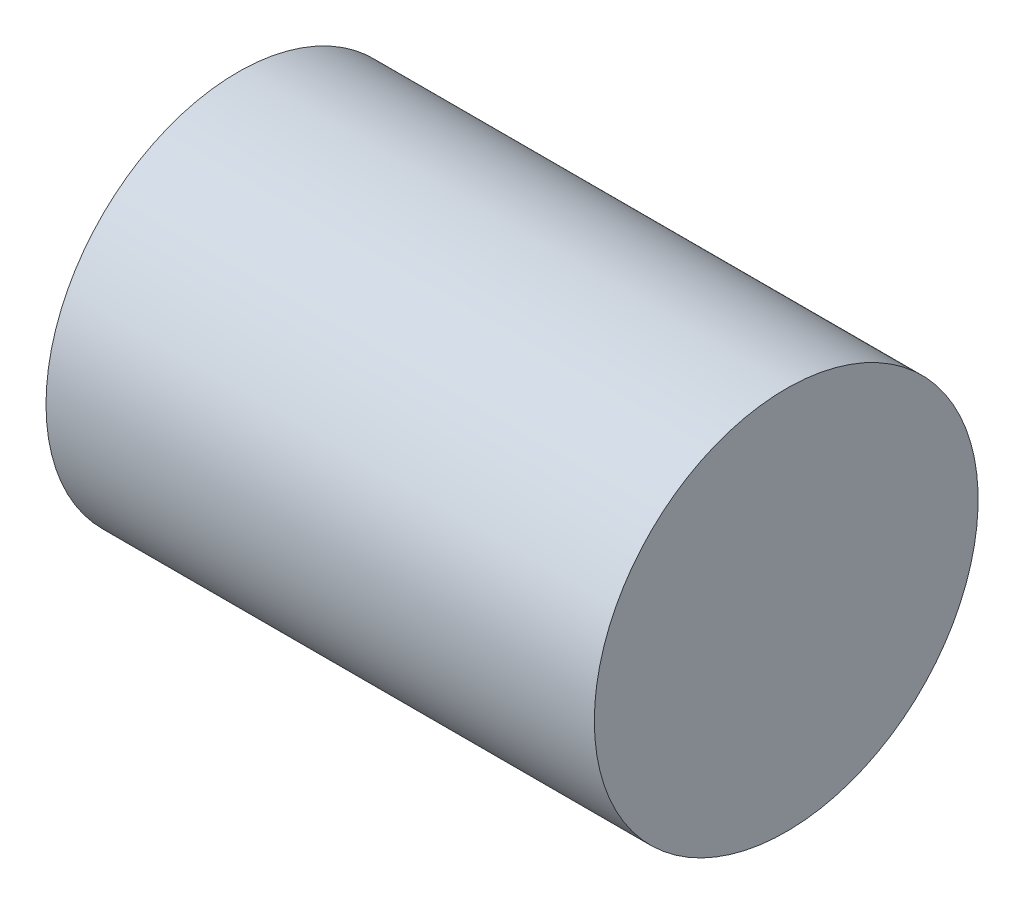
ISO-10303-21;
HEADER;
FILE_DESCRIPTION(('STEP AP214'),'2;1');
FILE_NAME('part.step','',(''),(''),'','','');
FILE_SCHEMA(('AUTOMOTIVE_DESIGN { 1 0 10303 214 1 1 1 1 }'));
ENDSEC;
DATA;
#1=APPLICATION_CONTEXT('core data for automotive mechanical design processes');
#2=APPLICATION_PROTOCOL_DEFINITION('international standard','automotive_design',2000,#1);
#3=PRODUCT_CONTEXT('',#1,'mechanical');
#4=PRODUCT('Part','Part','',(#3));
#5=PRODUCT_RELATED_PRODUCT_CATEGORY('part','',(#4));
#6=PRODUCT_DEFINITION_FORMATION('','',#4);
#7=PRODUCT_DEFINITION_CONTEXT('part definition',#1,'design');
#8=PRODUCT_DEFINITION('design','',#6,#7);
#9=PRODUCT_DEFINITION_SHAPE('','',#8);
#10=(LENGTH_UNIT() NAMED_UNIT(*) SI_UNIT(.MILLI.,.METRE.));
#11=(NAMED_UNIT(*) PLANE_ANGLE_UNIT() SI_UNIT($,.RADIAN.));
#12=(NAMED_UNIT(*) SI_UNIT($,.STERADIAN.) SOLID_ANGLE_UNIT());
#13=UNCERTAINTY_MEASURE_WITH_UNIT(LENGTH_MEASURE(1.E-05),#10,'distance_accuracy_value','');
#14=(GEOMETRIC_REPRESENTATION_CONTEXT(3) GLOBAL_UNCERTAINTY_ASSIGNED_CONTEXT((#13)) GLOBAL_UNIT_ASSIGNED_CONTEXT((#10,
#11,#12)) REPRESENTATION_CONTEXT('',''));
#15=CARTESIAN_POINT('',(0.,0.,0.));
#16=DIRECTION('',(0.,0.,1.));
#17=DIRECTION('',(1.,0.,0.));
#18=AXIS2_PLACEMENT_3D('',#15,#16,#17);
#19=CARTESIAN_POINT('',(0.,0.,0.));
#20=DIRECTION('',(-1.,0.,0.));
#21=DIRECTION('',(0.,0.,1.));
#22=AXIS2_PLACEMENT_3D('',#19,#20,#21);
#23=PLANE('',#22);
#24=CARTESIAN_POINT('',(0.,14.,0.));
#25=DIRECTION('',(-1.,0.,0.));
#26=DIRECTION('',(0.,0.,1.));
#27=AXIS2_PLACEMENT_3D('',#24,#25,#26);
#28=CIRCLE('',#27,14.);
#29=CARTESIAN_POINT('',(0.,14.,14.));
#30=VERTEX_POINT('',#29);
#31=EDGE_CURVE('E46',#30,#30,#28,.T.);
#32=ORIENTED_EDGE('',*,*,#31,.T.);
#33=EDGE_LOOP('',(#32));
#34=FACE_BOUND('',#33,.T.);
#35=ADVANCED_FACE('F39',(#34),#23,.T.);
#36=CARTESIAN_POINT('',(40.,0.,0.));
#37=DIRECTION('',(1.,0.,0.));
#38=DIRECTION('',(0.,0.,-1.));
#39=AXIS2_PLACEMENT_3D('',#36,#37,#38);
#40=PLANE('',#39);
#41=CARTESIAN_POINT('',(40.,14.,0.));
#42=DIRECTION('',(-1.,0.,0.));
#43=DIRECTION('',(0.,0.,1.));
#44=AXIS2_PLACEMENT_3D('',#41,#42,#43);
#45=CIRCLE('',#44,14.);
#46=CARTESIAN_POINT('',(40.,14.,14.));
#47=VERTEX_POINT('',#46);
#48=EDGE_CURVE('E10',#47,#47,#45,.T.);
#49=ORIENTED_EDGE('',*,*,#48,.F.);
#50=EDGE_LOOP('',(#49));
#51=FACE_BOUND('',#50,.T.);
#52=ADVANCED_FACE('F56',(#51),#40,.T.);
#53=CARTESIAN_POINT('',(0.,14.,0.));
#54=DIRECTION('',(-1.,0.,0.));
#55=DIRECTION('',(0.,0.,1.));
#56=AXIS2_PLACEMENT_3D('',#53,#54,#55);
#57=CYLINDRICAL_SURFACE('',#56,14.);
#58=ORIENTED_EDGE('',*,*,#48,.T.);
#59=EDGE_LOOP('',(#58));
#60=FACE_BOUND('',#59,.T.);
#61=ORIENTED_EDGE('',*,*,#31,.F.);
#62=EDGE_LOOP('',(#61));
#63=FACE_BOUND('',#62,.T.);
#64=ADVANCED_FACE('F54',(#60,#63),#57,.T.);
#65=CLOSED_SHELL('',(#35,#52,#64));
#66=MANIFOLD_SOLID_BREP('B2',#65);
#67=ADVANCED_BREP_SHAPE_REPRESENTATION('',(#18,#66),#14);
#68=SHAPE_DEFINITION_REPRESENTATION(#9,#67);
ENDSEC;
END-ISO-10303-21;
